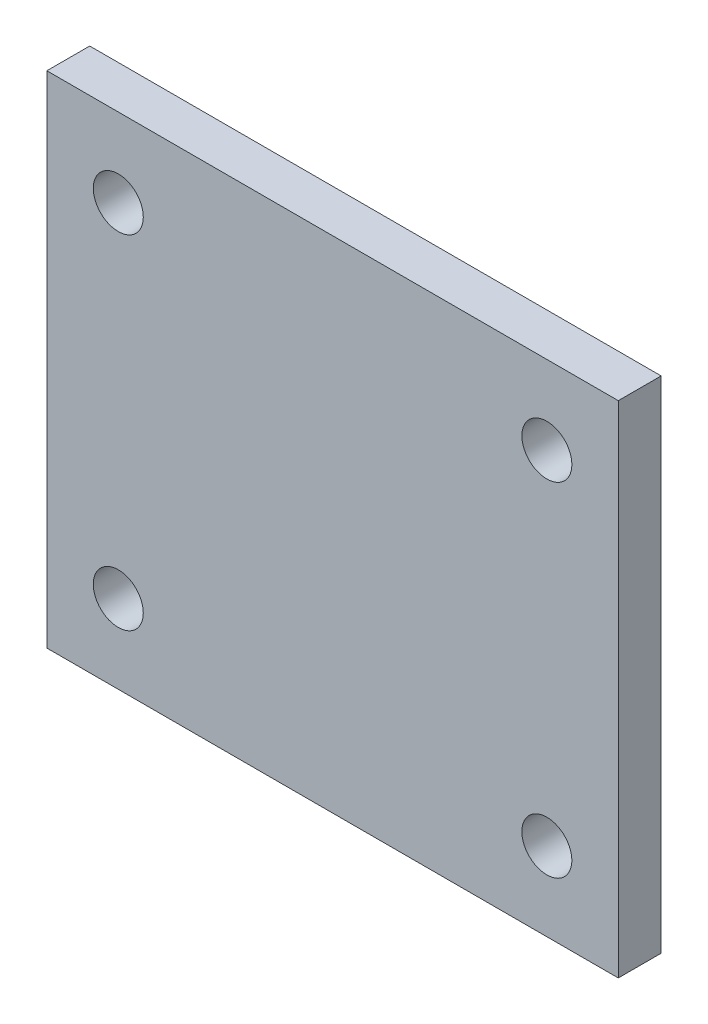
ISO-10303-21;
HEADER;
FILE_DESCRIPTION(('STEP AP214'),'2;1');
FILE_NAME('part.step','',(''),(''),'','','');
FILE_SCHEMA(('AUTOMOTIVE_DESIGN { 1 0 10303 214 1 1 1 1 }'));
ENDSEC;
DATA;
#1=APPLICATION_CONTEXT('core data for automotive mechanical design processes');
#2=APPLICATION_PROTOCOL_DEFINITION('international standard','automotive_design',2000,#1);
#3=PRODUCT_CONTEXT('',#1,'mechanical');
#4=PRODUCT('Part','Part','',(#3));
#5=PRODUCT_RELATED_PRODUCT_CATEGORY('part','',(#4));
#6=PRODUCT_DEFINITION_FORMATION('','',#4);
#7=PRODUCT_DEFINITION_CONTEXT('part definition',#1,'design');
#8=PRODUCT_DEFINITION('design','',#6,#7);
#9=PRODUCT_DEFINITION_SHAPE('','',#8);
#10=(LENGTH_UNIT() NAMED_UNIT(*) SI_UNIT(.MILLI.,.METRE.));
#11=(NAMED_UNIT(*) PLANE_ANGLE_UNIT() SI_UNIT($,.RADIAN.));
#12=(NAMED_UNIT(*) SI_UNIT($,.STERADIAN.) SOLID_ANGLE_UNIT());
#13=UNCERTAINTY_MEASURE_WITH_UNIT(LENGTH_MEASURE(1.E-05),#10,'distance_accuracy_value','');
#14=(GEOMETRIC_REPRESENTATION_CONTEXT(3) GLOBAL_UNCERTAINTY_ASSIGNED_CONTEXT((#13)) GLOBAL_UNIT_ASSIGNED_CONTEXT((#10,
#11,#12)) REPRESENTATION_CONTEXT('',''));
#15=CARTESIAN_POINT('',(0.,0.,0.));
#16=DIRECTION('',(0.,0.,1.));
#17=DIRECTION('',(1.,0.,0.));
#18=AXIS2_PLACEMENT_3D('',#15,#16,#17);
#19=CARTESIAN_POINT('',(0.,0.,3.));
#20=DIRECTION('',(0.,0.,-1.));
#21=DIRECTION('',(-1.,0.,0.));
#22=AXIS2_PLACEMENT_3D('',#19,#20,#21);
#23=PLANE('',#22);
#24=DIRECTION('',(0.,-1.,0.));
#25=VECTOR('',#24,1.);
#26=CARTESIAN_POINT('',(0.,0.,3.));
#27=LINE('',#26,#25);
#28=CARTESIAN_POINT('',(0.,35.,3.));
#29=VERTEX_POINT('',#28);
#30=CARTESIAN_POINT('',(0.,0.,3.));
#31=VERTEX_POINT('',#30);
#32=EDGE_CURVE('E85',#29,#31,#27,.T.);
#33=ORIENTED_EDGE('',*,*,#32,.T.);
#34=DIRECTION('',(1.,0.,0.));
#35=VECTOR('',#34,1.);
#36=CARTESIAN_POINT('',(0.,0.,3.));
#37=LINE('',#36,#35);
#38=CARTESIAN_POINT('',(40.,0.,3.));
#39=VERTEX_POINT('',#38);
#40=EDGE_CURVE('E80',#31,#39,#37,.T.);
#41=ORIENTED_EDGE('',*,*,#40,.T.);
#42=DIRECTION('',(0.,1.,0.));
#43=VECTOR('',#42,1.);
#44=CARTESIAN_POINT('',(40.,0.,3.));
#45=LINE('',#44,#43);
#46=CARTESIAN_POINT('',(40.,35.,3.));
#47=VERTEX_POINT('',#46);
#48=EDGE_CURVE('E83',#39,#47,#45,.T.);
#49=ORIENTED_EDGE('',*,*,#48,.T.);
#50=DIRECTION('',(-1.,0.,0.));
#51=VECTOR('',#50,1.);
#52=CARTESIAN_POINT('',(0.,35.,3.));
#53=LINE('',#52,#51);
#54=EDGE_CURVE('E50',#47,#29,#53,.T.);
#55=ORIENTED_EDGE('',*,*,#54,.T.);
#56=EDGE_LOOP('',(#33,#41,#49,#55));
#57=FACE_BOUND('',#56,.T.);
#58=CARTESIAN_POINT('',(5.,5.5,3.));
#59=DIRECTION('',(0.,0.,1.));
#60=DIRECTION('',(1.,0.,0.));
#61=AXIS2_PLACEMENT_3D('',#58,#59,#60);
#62=CIRCLE('',#61,1.75);
#63=CARTESIAN_POINT('',(6.75,5.5,3.));
#64=VERTEX_POINT('',#63);
#65=EDGE_CURVE('E100',#64,#64,#62,.T.);
#66=ORIENTED_EDGE('',*,*,#65,.F.);
#67=EDGE_LOOP('',(#66));
#68=FACE_BOUND('',#67,.T.);
#69=CARTESIAN_POINT('',(5.,29.5,3.));
#70=DIRECTION('',(0.,0.,1.));
#71=DIRECTION('',(1.,0.,0.));
#72=AXIS2_PLACEMENT_3D('',#69,#70,#71);
#73=CIRCLE('',#72,1.75);
#74=CARTESIAN_POINT('',(6.75,29.5,3.));
#75=VERTEX_POINT('',#74);
#76=EDGE_CURVE('E115',#75,#75,#73,.T.);
#77=ORIENTED_EDGE('',*,*,#76,.F.);
#78=EDGE_LOOP('',(#77));
#79=FACE_BOUND('',#78,.T.);
#80=CARTESIAN_POINT('',(35.,5.5,3.));
#81=DIRECTION('',(0.,0.,1.));
#82=DIRECTION('',(1.,0.,0.));
#83=AXIS2_PLACEMENT_3D('',#80,#81,#82);
#84=CIRCLE('',#83,1.75);
#85=CARTESIAN_POINT('',(36.75,5.5,3.));
#86=VERTEX_POINT('',#85);
#87=EDGE_CURVE('E121',#86,#86,#84,.T.);
#88=ORIENTED_EDGE('',*,*,#87,.F.);
#89=EDGE_LOOP('',(#88));
#90=FACE_BOUND('',#89,.T.);
#91=CARTESIAN_POINT('',(35.,29.5,3.));
#92=DIRECTION('',(0.,0.,1.));
#93=DIRECTION('',(1.,0.,0.));
#94=AXIS2_PLACEMENT_3D('',#91,#92,#93);
#95=CIRCLE('',#94,1.75);
#96=CARTESIAN_POINT('',(36.75,29.5,3.));
#97=VERTEX_POINT('',#96);
#98=EDGE_CURVE('E127',#97,#97,#95,.T.);
#99=ORIENTED_EDGE('',*,*,#98,.F.);
#100=EDGE_LOOP('',(#99));
#101=FACE_BOUND('',#100,.T.);
#102=ADVANCED_FACE('F33',(#57,#68,#79,#90,#101),#23,.F.);
#103=CARTESIAN_POINT('',(0.,0.,0.));
#104=DIRECTION('',(0.,0.,-1.));
#105=DIRECTION('',(-1.,0.,0.));
#106=AXIS2_PLACEMENT_3D('',#103,#104,#105);
#107=PLANE('',#106);
#108=CARTESIAN_POINT('',(35.,5.5,0.));
#109=DIRECTION('',(0.,0.,1.));
#110=DIRECTION('',(1.,0.,0.));
#111=AXIS2_PLACEMENT_3D('',#108,#109,#110);
#112=CIRCLE('',#111,1.75);
#113=CARTESIAN_POINT('',(36.75,5.5,0.));
#114=VERTEX_POINT('',#113);
#115=EDGE_CURVE('E124',#114,#114,#112,.T.);
#116=ORIENTED_EDGE('',*,*,#115,.T.);
#117=EDGE_LOOP('',(#116));
#118=FACE_BOUND('',#117,.T.);
#119=CARTESIAN_POINT('',(5.,5.5,0.));
#120=DIRECTION('',(0.,0.,1.));
#121=DIRECTION('',(1.,0.,0.));
#122=AXIS2_PLACEMENT_3D('',#119,#120,#121);
#123=CIRCLE('',#122,1.75);
#124=CARTESIAN_POINT('',(6.75,5.5,0.));
#125=VERTEX_POINT('',#124);
#126=EDGE_CURVE('E112',#125,#125,#123,.T.);
#127=ORIENTED_EDGE('',*,*,#126,.T.);
#128=EDGE_LOOP('',(#127));
#129=FACE_BOUND('',#128,.T.);
#130=DIRECTION('',(0.,-1.,0.));
#131=VECTOR('',#130,1.);
#132=CARTESIAN_POINT('',(0.,0.,0.));
#133=LINE('',#132,#131);
#134=CARTESIAN_POINT('',(0.,35.,0.));
#135=VERTEX_POINT('',#134);
#136=CARTESIAN_POINT('',(0.,0.,0.));
#137=VERTEX_POINT('',#136);
#138=EDGE_CURVE('E97',#135,#137,#133,.T.);
#139=ORIENTED_EDGE('',*,*,#138,.F.);
#140=DIRECTION('',(-1.,0.,0.));
#141=VECTOR('',#140,1.);
#142=CARTESIAN_POINT('',(0.,35.,0.));
#143=LINE('',#142,#141);
#144=CARTESIAN_POINT('',(40.,35.,0.));
#145=VERTEX_POINT('',#144);
#146=EDGE_CURVE('E73',#145,#135,#143,.T.);
#147=ORIENTED_EDGE('',*,*,#146,.F.);
#148=DIRECTION('',(0.,1.,0.));
#149=VECTOR('',#148,1.);
#150=CARTESIAN_POINT('',(40.,0.,0.));
#151=LINE('',#150,#149);
#152=CARTESIAN_POINT('',(40.,0.,0.));
#153=VERTEX_POINT('',#152);
#154=EDGE_CURVE('E67',#153,#145,#151,.T.);
#155=ORIENTED_EDGE('',*,*,#154,.F.);
#156=DIRECTION('',(1.,0.,0.));
#157=VECTOR('',#156,1.);
#158=CARTESIAN_POINT('',(0.,0.,0.));
#159=LINE('',#158,#157);
#160=EDGE_CURVE('E89',#137,#153,#159,.T.);
#161=ORIENTED_EDGE('',*,*,#160,.F.);
#162=EDGE_LOOP('',(#139,#147,#155,#161));
#163=FACE_BOUND('',#162,.T.);
#164=CARTESIAN_POINT('',(5.,29.5,0.));
#165=DIRECTION('',(0.,0.,1.));
#166=DIRECTION('',(1.,0.,0.));
#167=AXIS2_PLACEMENT_3D('',#164,#165,#166);
#168=CIRCLE('',#167,1.75);
#169=CARTESIAN_POINT('',(6.75,29.5,0.));
#170=VERTEX_POINT('',#169);
#171=EDGE_CURVE('E118',#170,#170,#168,.T.);
#172=ORIENTED_EDGE('',*,*,#171,.T.);
#173=EDGE_LOOP('',(#172));
#174=FACE_BOUND('',#173,.T.);
#175=CARTESIAN_POINT('',(35.,29.5,0.));
#176=DIRECTION('',(0.,0.,1.));
#177=DIRECTION('',(1.,0.,0.));
#178=AXIS2_PLACEMENT_3D('',#175,#176,#177);
#179=CIRCLE('',#178,1.75);
#180=CARTESIAN_POINT('',(36.75,29.5,0.));
#181=VERTEX_POINT('',#180);
#182=EDGE_CURVE('E130',#181,#181,#179,.T.);
#183=ORIENTED_EDGE('',*,*,#182,.T.);
#184=EDGE_LOOP('',(#183));
#185=FACE_BOUND('',#184,.T.);
#186=ADVANCED_FACE('F108',(#118,#129,#163,#174,#185),#107,.T.);
#187=CARTESIAN_POINT('',(0.,0.,3.));
#188=DIRECTION('',(1.,0.,0.));
#189=DIRECTION('',(0.,0.,-1.));
#190=AXIS2_PLACEMENT_3D('',#187,#188,#189);
#191=PLANE('',#190);
#192=ORIENTED_EDGE('',*,*,#138,.T.);
#193=DIRECTION('',(0.,0.,-1.));
#194=VECTOR('',#193,1.);
#195=CARTESIAN_POINT('',(0.,0.,3.));
#196=LINE('',#195,#194);
#197=EDGE_CURVE('E11',#31,#137,#196,.T.);
#198=ORIENTED_EDGE('',*,*,#197,.F.);
#199=ORIENTED_EDGE('',*,*,#32,.F.);
#200=DIRECTION('',(0.,0.,-1.));
#201=VECTOR('',#200,1.);
#202=CARTESIAN_POINT('',(0.,35.,3.));
#203=LINE('',#202,#201);
#204=EDGE_CURVE('E93',#29,#135,#203,.T.);
#205=ORIENTED_EDGE('',*,*,#204,.T.);
#206=EDGE_LOOP('',(#192,#198,#199,#205));
#207=FACE_BOUND('',#206,.T.);
#208=ADVANCED_FACE('F35',(#207),#191,.F.);
#209=CARTESIAN_POINT('',(0.,0.,3.));
#210=DIRECTION('',(0.,1.,0.));
#211=DIRECTION('',(0.,0.,1.));
#212=AXIS2_PLACEMENT_3D('',#209,#210,#211);
#213=PLANE('',#212);
#214=ORIENTED_EDGE('',*,*,#160,.T.);
#215=DIRECTION('',(0.,0.,-1.));
#216=VECTOR('',#215,1.);
#217=CARTESIAN_POINT('',(40.,0.,3.));
#218=LINE('',#217,#216);
#219=EDGE_CURVE('E42',#39,#153,#218,.T.);
#220=ORIENTED_EDGE('',*,*,#219,.F.);
#221=ORIENTED_EDGE('',*,*,#40,.F.);
#222=ORIENTED_EDGE('',*,*,#197,.T.);
#223=EDGE_LOOP('',(#214,#220,#221,#222));
#224=FACE_BOUND('',#223,.T.);
#225=ADVANCED_FACE('F88',(#224),#213,.F.);
#226=CARTESIAN_POINT('',(40.,0.,3.));
#227=DIRECTION('',(-1.,0.,0.));
#228=DIRECTION('',(0.,0.,1.));
#229=AXIS2_PLACEMENT_3D('',#226,#227,#228);
#230=PLANE('',#229);
#231=ORIENTED_EDGE('',*,*,#154,.T.);
#232=DIRECTION('',(0.,0.,-1.));
#233=VECTOR('',#232,1.);
#234=CARTESIAN_POINT('',(40.,35.,3.));
#235=LINE('',#234,#233);
#236=EDGE_CURVE('E90',#47,#145,#235,.T.);
#237=ORIENTED_EDGE('',*,*,#236,.F.);
#238=ORIENTED_EDGE('',*,*,#48,.F.);
#239=ORIENTED_EDGE('',*,*,#219,.T.);
#240=EDGE_LOOP('',(#231,#237,#238,#239));
#241=FACE_BOUND('',#240,.T.);
#242=ADVANCED_FACE('F91',(#241),#230,.F.);
#243=CARTESIAN_POINT('',(0.,35.,3.));
#244=DIRECTION('',(0.,-1.,0.));
#245=DIRECTION('',(0.,0.,-1.));
#246=AXIS2_PLACEMENT_3D('',#243,#244,#245);
#247=PLANE('',#246);
#248=ORIENTED_EDGE('',*,*,#146,.T.);
#249=ORIENTED_EDGE('',*,*,#204,.F.);
#250=ORIENTED_EDGE('',*,*,#54,.F.);
#251=ORIENTED_EDGE('',*,*,#236,.T.);
#252=EDGE_LOOP('',(#248,#249,#250,#251));
#253=FACE_BOUND('',#252,.T.);
#254=ADVANCED_FACE('F105',(#253),#247,.F.);
#255=CARTESIAN_POINT('',(5.,5.5,3.));
#256=DIRECTION('',(0.,0.,-1.));
#257=DIRECTION('',(-1.,0.,0.));
#258=AXIS2_PLACEMENT_3D('',#255,#256,#257);
#259=CYLINDRICAL_SURFACE('',#258,1.75);
#260=ORIENTED_EDGE('',*,*,#65,.T.);
#261=EDGE_LOOP('',(#260));
#262=FACE_BOUND('',#261,.T.);
#263=ORIENTED_EDGE('',*,*,#126,.F.);
#264=EDGE_LOOP('',(#263));
#265=FACE_BOUND('',#264,.T.);
#266=ADVANCED_FACE('F147',(#262,#265),#259,.F.);
#267=CARTESIAN_POINT('',(5.,29.5,3.));
#268=DIRECTION('',(0.,0.,-1.));
#269=DIRECTION('',(-1.,0.,0.));
#270=AXIS2_PLACEMENT_3D('',#267,#268,#269);
#271=CYLINDRICAL_SURFACE('',#270,1.75);
#272=ORIENTED_EDGE('',*,*,#76,.T.);
#273=EDGE_LOOP('',(#272));
#274=FACE_BOUND('',#273,.T.);
#275=ORIENTED_EDGE('',*,*,#171,.F.);
#276=EDGE_LOOP('',(#275));
#277=FACE_BOUND('',#276,.T.);
#278=ADVANCED_FACE('F193',(#274,#277),#271,.F.);
#279=CARTESIAN_POINT('',(35.,5.5,3.));
#280=DIRECTION('',(0.,0.,-1.));
#281=DIRECTION('',(-1.,0.,0.));
#282=AXIS2_PLACEMENT_3D('',#279,#280,#281);
#283=CYLINDRICAL_SURFACE('',#282,1.75);
#284=ORIENTED_EDGE('',*,*,#87,.T.);
#285=EDGE_LOOP('',(#284));
#286=FACE_BOUND('',#285,.T.);
#287=ORIENTED_EDGE('',*,*,#115,.F.);
#288=EDGE_LOOP('',(#287));
#289=FACE_BOUND('',#288,.T.);
#290=ADVANCED_FACE('F201',(#286,#289),#283,.F.);
#291=CARTESIAN_POINT('',(35.,29.5,3.));
#292=DIRECTION('',(0.,0.,-1.));
#293=DIRECTION('',(-1.,0.,0.));
#294=AXIS2_PLACEMENT_3D('',#291,#292,#293);
#295=CYLINDRICAL_SURFACE('',#294,1.75);
#296=ORIENTED_EDGE('',*,*,#98,.T.);
#297=EDGE_LOOP('',(#296));
#298=FACE_BOUND('',#297,.T.);
#299=ORIENTED_EDGE('',*,*,#182,.F.);
#300=EDGE_LOOP('',(#299));
#301=FACE_BOUND('',#300,.T.);
#302=ADVANCED_FACE('F136',(#298,#301),#295,.F.);
#303=CLOSED_SHELL('',(#102,#186,#208,#225,#242,#254,#266,#278,#290,#302));
#304=MANIFOLD_SOLID_BREP('B2',#303);
#305=ADVANCED_BREP_SHAPE_REPRESENTATION('',(#18,#304),#14);
#306=SHAPE_DEFINITION_REPRESENTATION(#9,#305);
ENDSEC;
END-ISO-10303-21;
